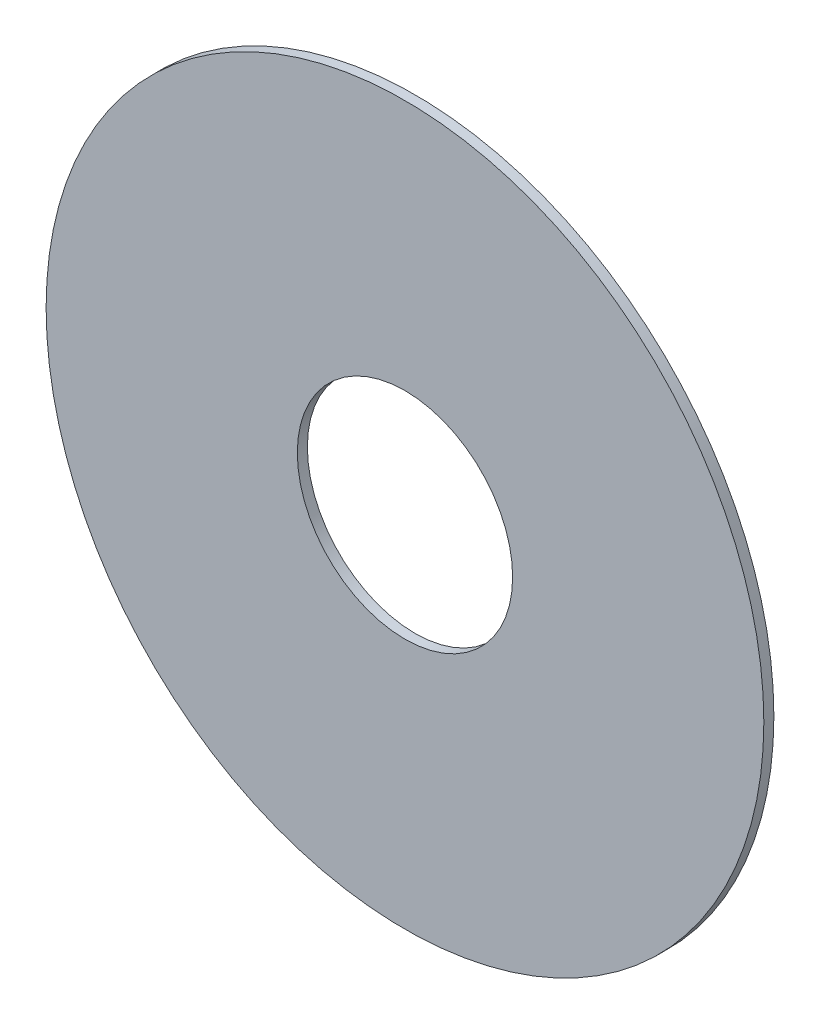
ISO-10303-21;
HEADER;
FILE_DESCRIPTION(('STEP AP214'),'2;1');
FILE_NAME('part.step','',(''),(''),'','','');
FILE_SCHEMA(('AUTOMOTIVE_DESIGN { 1 0 10303 214 1 1 1 1 }'));
ENDSEC;
DATA;
#1=APPLICATION_CONTEXT('core data for automotive mechanical design processes');
#2=APPLICATION_PROTOCOL_DEFINITION('international standard','automotive_design',2000,#1);
#3=PRODUCT_CONTEXT('',#1,'mechanical');
#4=PRODUCT('Part','Part','',(#3));
#5=PRODUCT_RELATED_PRODUCT_CATEGORY('part','',(#4));
#6=PRODUCT_DEFINITION_FORMATION('','',#4);
#7=PRODUCT_DEFINITION_CONTEXT('part definition',#1,'design');
#8=PRODUCT_DEFINITION('design','',#6,#7);
#9=PRODUCT_DEFINITION_SHAPE('','',#8);
#10=(LENGTH_UNIT() NAMED_UNIT(*) SI_UNIT(.MILLI.,.METRE.));
#11=(NAMED_UNIT(*) PLANE_ANGLE_UNIT() SI_UNIT($,.RADIAN.));
#12=(NAMED_UNIT(*) SI_UNIT($,.STERADIAN.) SOLID_ANGLE_UNIT());
#13=UNCERTAINTY_MEASURE_WITH_UNIT(LENGTH_MEASURE(1.E-05),#10,'distance_accuracy_value','');
#14=(GEOMETRIC_REPRESENTATION_CONTEXT(3) GLOBAL_UNCERTAINTY_ASSIGNED_CONTEXT((#13)) GLOBAL_UNIT_ASSIGNED_CONTEXT((#10,
#11,#12)) REPRESENTATION_CONTEXT('',''));
#15=CARTESIAN_POINT('',(0.,0.,0.));
#16=DIRECTION('',(0.,0.,1.));
#17=DIRECTION('',(1.,0.,0.));
#18=AXIS2_PLACEMENT_3D('',#15,#16,#17);
#19=CARTESIAN_POINT('',(173.228,-112.776,-0.045));
#20=DIRECTION('',(0.,0.,-1.));
#21=DIRECTION('',(0.,-1.,0.));
#22=AXIS2_PLACEMENT_3D('',#19,#20,#21);
#23=CYLINDRICAL_SURFACE('',#22,0.375);
#24=CARTESIAN_POINT('',(173.228,-112.776,1.67));
#25=DIRECTION('',(0.,0.,-1.));
#26=DIRECTION('',(0.,-1.,0.));
#27=AXIS2_PLACEMENT_3D('',#24,#25,#26);
#28=CIRCLE('',#27,0.375);
#29=CARTESIAN_POINT('',(173.228,-113.151,1.67));
#30=VERTEX_POINT('',#29);
#31=EDGE_CURVE('E26',#30,#30,#28,.T.);
#32=ORIENTED_EDGE('',*,*,#31,.T.);
#33=DIRECTION('',(0.,0.,1.));
#34=VECTOR('',#33,1.);
#35=CARTESIAN_POINT('',(173.228,-113.151,-0.045));
#36=LINE('',#35,#34);
#37=CARTESIAN_POINT('',(173.228,-113.151,1.705));
#38=VERTEX_POINT('',#37);
#39=EDGE_CURVE('E11',#30,#38,#36,.T.);
#40=ORIENTED_EDGE('',*,*,#39,.T.);
#41=CARTESIAN_POINT('',(173.228,-112.776,1.705));
#42=DIRECTION('',(0.,0.,-1.));
#43=DIRECTION('',(0.,-1.,0.));
#44=AXIS2_PLACEMENT_3D('',#41,#42,#43);
#45=CIRCLE('',#44,0.375);
#46=EDGE_CURVE('E64',#38,#38,#45,.T.);
#47=ORIENTED_EDGE('',*,*,#46,.F.);
#48=ORIENTED_EDGE('',*,*,#39,.F.);
#49=EDGE_LOOP('',(#32,#40,#47,#48));
#50=FACE_BOUND('',#49,.T.);
#51=ADVANCED_FACE('F17',(#50),#23,.F.);
#52=CARTESIAN_POINT('',(173.228,-112.776,1.67));
#53=DIRECTION('',(0.,0.,1.));
#54=DIRECTION('',(1.,0.,0.));
#55=AXIS2_PLACEMENT_3D('',#52,#53,#54);
#56=PLANE('',#55);
#57=ORIENTED_EDGE('',*,*,#31,.F.);
#58=EDGE_LOOP('',(#57));
#59=FACE_BOUND('',#58,.T.);
#60=CARTESIAN_POINT('',(173.228,-112.776,1.67));
#61=DIRECTION('',(0.,0.,1.));
#62=DIRECTION('',(1.,0.,0.));
#63=AXIS2_PLACEMENT_3D('',#60,#61,#62);
#64=CIRCLE('',#63,1.25);
#65=CARTESIAN_POINT('',(174.478,-112.776,1.67));
#66=VERTEX_POINT('',#65);
#67=EDGE_CURVE('E53',#66,#66,#64,.T.);
#68=ORIENTED_EDGE('',*,*,#67,.F.);
#69=EDGE_LOOP('',(#68));
#70=FACE_BOUND('',#69,.T.);
#71=ADVANCED_FACE('F74',(#59,#70),#56,.F.);
#72=CARTESIAN_POINT('',(173.228,-112.776,1.705));
#73=DIRECTION('',(0.,0.,1.));
#74=DIRECTION('',(1.,0.,0.));
#75=AXIS2_PLACEMENT_3D('',#72,#73,#74);
#76=PLANE('',#75);
#77=ORIENTED_EDGE('',*,*,#46,.T.);
#78=EDGE_LOOP('',(#77));
#79=FACE_BOUND('',#78,.T.);
#80=CARTESIAN_POINT('',(173.228,-112.776,1.705));
#81=DIRECTION('',(0.,0.,1.));
#82=DIRECTION('',(1.,0.,0.));
#83=AXIS2_PLACEMENT_3D('',#80,#81,#82);
#84=CIRCLE('',#83,1.25);
#85=CARTESIAN_POINT('',(174.478,-112.776,1.705));
#86=VERTEX_POINT('',#85);
#87=EDGE_CURVE('E51',#86,#86,#84,.T.);
#88=ORIENTED_EDGE('',*,*,#87,.T.);
#89=EDGE_LOOP('',(#88));
#90=FACE_BOUND('',#89,.T.);
#91=ADVANCED_FACE('F57',(#79,#90),#76,.T.);
#92=CARTESIAN_POINT('',(173.228,-112.776,1.67));
#93=DIRECTION('',(0.,0.,1.));
#94=DIRECTION('',(1.,0.,0.));
#95=AXIS2_PLACEMENT_3D('',#92,#93,#94);
#96=CYLINDRICAL_SURFACE('',#95,1.25);
#97=ORIENTED_EDGE('',*,*,#87,.F.);
#98=DIRECTION('',(0.,0.,1.));
#99=VECTOR('',#98,1.);
#100=CARTESIAN_POINT('',(174.478,-112.776,1.67));
#101=LINE('',#100,#99);
#102=EDGE_CURVE('E48',#66,#86,#101,.T.);
#103=ORIENTED_EDGE('',*,*,#102,.F.);
#104=ORIENTED_EDGE('',*,*,#67,.T.);
#105=ORIENTED_EDGE('',*,*,#102,.T.);
#106=EDGE_LOOP('',(#97,#103,#104,#105));
#107=FACE_BOUND('',#106,.T.);
#108=ADVANCED_FACE('F50',(#107),#96,.T.);
#109=CLOSED_SHELL('',(#51,#71,#91,#108));
#110=MANIFOLD_SOLID_BREP('B1',#109);
#111=ADVANCED_BREP_SHAPE_REPRESENTATION('',(#18,#110),#14);
#112=SHAPE_DEFINITION_REPRESENTATION(#9,#111);
ENDSEC;
END-ISO-10303-21;
